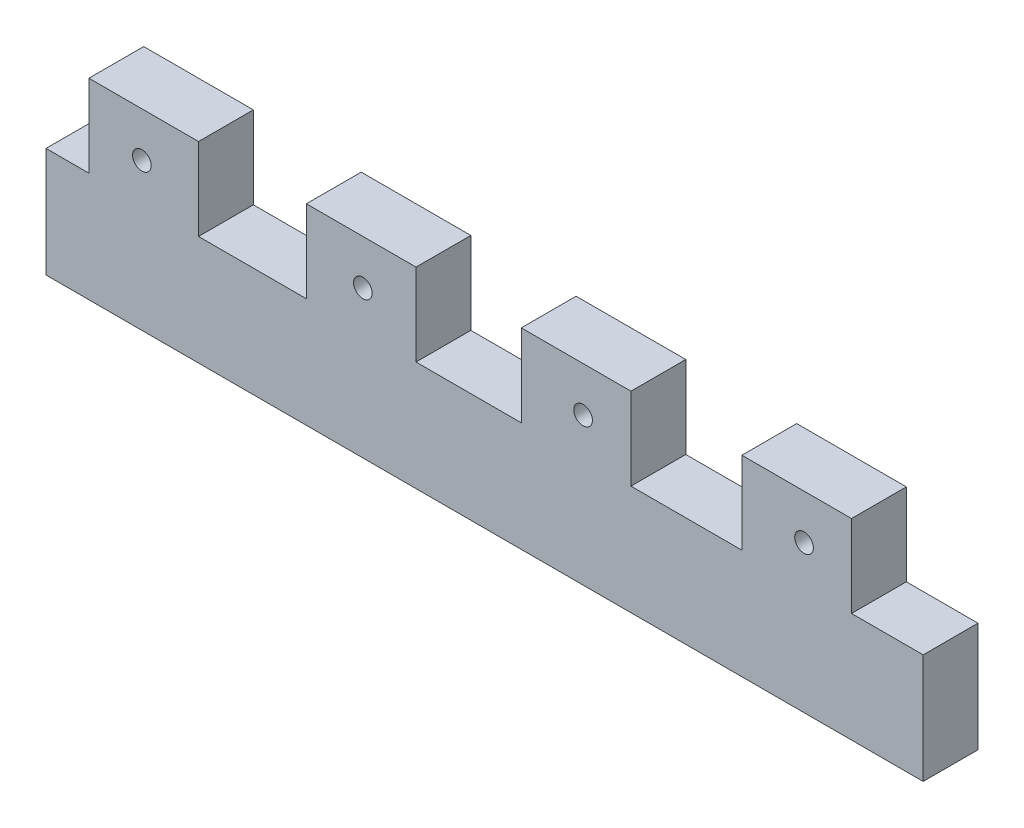
ISO-10303-21;
HEADER;
FILE_DESCRIPTION(('STEP AP214'),'2;1');
FILE_NAME('part.step','',(''),(''),'','','');
FILE_SCHEMA(('AUTOMOTIVE_DESIGN { 1 0 10303 214 1 1 1 1 }'));
ENDSEC;
DATA;
#1=APPLICATION_CONTEXT('core data for automotive mechanical design processes');
#2=APPLICATION_PROTOCOL_DEFINITION('international standard','automotive_design',2000,#1);
#3=PRODUCT_CONTEXT('',#1,'mechanical');
#4=PRODUCT('Part','Part','',(#3));
#5=PRODUCT_RELATED_PRODUCT_CATEGORY('part','',(#4));
#6=PRODUCT_DEFINITION_FORMATION('','',#4);
#7=PRODUCT_DEFINITION_CONTEXT('part definition',#1,'design');
#8=PRODUCT_DEFINITION('design','',#6,#7);
#9=PRODUCT_DEFINITION_SHAPE('','',#8);
#10=(LENGTH_UNIT() NAMED_UNIT(*) SI_UNIT(.MILLI.,.METRE.));
#11=(NAMED_UNIT(*) PLANE_ANGLE_UNIT() SI_UNIT($,.RADIAN.));
#12=(NAMED_UNIT(*) SI_UNIT($,.STERADIAN.) SOLID_ANGLE_UNIT());
#13=UNCERTAINTY_MEASURE_WITH_UNIT(LENGTH_MEASURE(1.E-05),#10,'distance_accuracy_value','');
#14=(GEOMETRIC_REPRESENTATION_CONTEXT(3) GLOBAL_UNCERTAINTY_ASSIGNED_CONTEXT((#13)) GLOBAL_UNIT_ASSIGNED_CONTEXT((#10,
#11,#12)) REPRESENTATION_CONTEXT('',''));
#15=CARTESIAN_POINT('',(0.,0.,0.));
#16=DIRECTION('',(0.,0.,1.));
#17=DIRECTION('',(1.,0.,0.));
#18=AXIS2_PLACEMENT_3D('',#15,#16,#17);
#19=CARTESIAN_POINT('',(4.96637370783451,0.,6.35));
#20=DIRECTION('',(-1.,0.,0.));
#21=DIRECTION('',(0.,0.,1.));
#22=AXIS2_PLACEMENT_3D('',#19,#20,#21);
#23=PLANE('',#22);
#24=DIRECTION('',(0.,1.,0.));
#25=VECTOR('',#24,1.);
#26=CARTESIAN_POINT('',(4.96637370783451,0.,0.));
#27=LINE('',#26,#25);
#28=CARTESIAN_POINT('',(4.96637370783451,12.7,0.));
#29=VERTEX_POINT('',#28);
#30=CARTESIAN_POINT('',(4.96637370783451,22.225,0.));
#31=VERTEX_POINT('',#30);
#32=EDGE_CURVE('E277',#29,#31,#27,.T.);
#33=ORIENTED_EDGE('',*,*,#32,.F.);
#34=DIRECTION('',(0.,0.,-1.));
#35=VECTOR('',#34,1.);
#36=CARTESIAN_POINT('',(4.96637370783451,12.7,6.35));
#37=LINE('',#36,#35);
#38=CARTESIAN_POINT('',(4.96637370783451,12.7,6.35));
#39=VERTEX_POINT('',#38);
#40=EDGE_CURVE('E11',#39,#29,#37,.T.);
#41=ORIENTED_EDGE('',*,*,#40,.F.);
#42=DIRECTION('',(0.,1.,0.));
#43=VECTOR('',#42,1.);
#44=CARTESIAN_POINT('',(4.96637370783451,0.,6.35));
#45=LINE('',#44,#43);
#46=CARTESIAN_POINT('',(4.96637370783451,22.225,6.35));
#47=VERTEX_POINT('',#46);
#48=EDGE_CURVE('E226',#39,#47,#45,.T.);
#49=ORIENTED_EDGE('',*,*,#48,.T.);
#50=DIRECTION('',(0.,0.,-1.));
#51=VECTOR('',#50,1.);
#52=CARTESIAN_POINT('',(4.96637370783451,22.225,6.35));
#53=LINE('',#52,#51);
#54=EDGE_CURVE('E62',#47,#31,#53,.T.);
#55=ORIENTED_EDGE('',*,*,#54,.T.);
#56=EDGE_LOOP('',(#33,#41,#49,#55));
#57=FACE_BOUND('',#56,.T.);
#58=ADVANCED_FACE('F45',(#57),#23,.T.);
#59=CARTESIAN_POINT('',(0.,12.7,6.35));
#60=DIRECTION('',(0.,1.,0.));
#61=DIRECTION('',(0.,0.,1.));
#62=AXIS2_PLACEMENT_3D('',#59,#60,#61);
#63=PLANE('',#62);
#64=DIRECTION('',(1.,0.,0.));
#65=VECTOR('',#64,1.);
#66=CARTESIAN_POINT('',(0.,12.7,0.));
#67=LINE('',#66,#65);
#68=CARTESIAN_POINT('',(0.,12.7,0.));
#69=VERTEX_POINT('',#68);
#70=EDGE_CURVE('E280',#69,#29,#67,.T.);
#71=ORIENTED_EDGE('',*,*,#70,.F.);
#72=DIRECTION('',(0.,0.,-1.));
#73=VECTOR('',#72,1.);
#74=CARTESIAN_POINT('',(0.,12.7,6.35));
#75=LINE('',#74,#73);
#76=CARTESIAN_POINT('',(0.,12.7,6.35));
#77=VERTEX_POINT('',#76);
#78=EDGE_CURVE('E54',#77,#69,#75,.T.);
#79=ORIENTED_EDGE('',*,*,#78,.F.);
#80=DIRECTION('',(1.,0.,0.));
#81=VECTOR('',#80,1.);
#82=CARTESIAN_POINT('',(0.,12.7,6.35));
#83=LINE('',#82,#81);
#84=EDGE_CURVE('E212',#77,#39,#83,.T.);
#85=ORIENTED_EDGE('',*,*,#84,.T.);
#86=ORIENTED_EDGE('',*,*,#40,.T.);
#87=EDGE_LOOP('',(#71,#79,#85,#86));
#88=FACE_BOUND('',#87,.T.);
#89=ADVANCED_FACE('F395',(#88),#63,.T.);
#90=CARTESIAN_POINT('',(0.,0.,6.35));
#91=DIRECTION('',(-1.,0.,0.));
#92=DIRECTION('',(0.,0.,1.));
#93=AXIS2_PLACEMENT_3D('',#90,#91,#92);
#94=PLANE('',#93);
#95=DIRECTION('',(0.,1.,0.));
#96=VECTOR('',#95,1.);
#97=CARTESIAN_POINT('',(0.,0.,0.));
#98=LINE('',#97,#96);
#99=CARTESIAN_POINT('',(0.,0.,0.));
#100=VERTEX_POINT('',#99);
#101=EDGE_CURVE('E285',#100,#69,#98,.T.);
#102=ORIENTED_EDGE('',*,*,#101,.F.);
#103=DIRECTION('',(0.,0.,-1.));
#104=VECTOR('',#103,1.);
#105=CARTESIAN_POINT('',(0.,0.,6.35));
#106=LINE('',#105,#104);
#107=CARTESIAN_POINT('',(0.,0.,6.35));
#108=VERTEX_POINT('',#107);
#109=EDGE_CURVE('E387',#108,#100,#106,.T.);
#110=ORIENTED_EDGE('',*,*,#109,.F.);
#111=DIRECTION('',(0.,1.,0.));
#112=VECTOR('',#111,1.);
#113=CARTESIAN_POINT('',(0.,0.,6.35));
#114=LINE('',#113,#112);
#115=EDGE_CURVE('E225',#108,#77,#114,.T.);
#116=ORIENTED_EDGE('',*,*,#115,.T.);
#117=ORIENTED_EDGE('',*,*,#78,.T.);
#118=EDGE_LOOP('',(#102,#110,#116,#117));
#119=FACE_BOUND('',#118,.T.);
#120=ADVANCED_FACE('F393',(#119),#94,.T.);
#121=CARTESIAN_POINT('',(0.,0.,6.35));
#122=DIRECTION('',(0.,1.,0.));
#123=DIRECTION('',(0.,0.,1.));
#124=AXIS2_PLACEMENT_3D('',#121,#122,#123);
#125=PLANE('',#124);
#126=DIRECTION('',(1.,0.,0.));
#127=VECTOR('',#126,1.);
#128=CARTESIAN_POINT('',(0.,0.,0.));
#129=LINE('',#128,#127);
#130=CARTESIAN_POINT('',(101.6,0.,0.));
#131=VERTEX_POINT('',#130);
#132=EDGE_CURVE('E290',#100,#131,#129,.T.);
#133=ORIENTED_EDGE('',*,*,#132,.T.);
#134=DIRECTION('',(0.,0.,-1.));
#135=VECTOR('',#134,1.);
#136=CARTESIAN_POINT('',(101.6,0.,6.35));
#137=LINE('',#136,#135);
#138=CARTESIAN_POINT('',(101.6,0.,6.35));
#139=VERTEX_POINT('',#138);
#140=EDGE_CURVE('E383',#139,#131,#137,.T.);
#141=ORIENTED_EDGE('',*,*,#140,.F.);
#142=DIRECTION('',(1.,0.,0.));
#143=VECTOR('',#142,1.);
#144=CARTESIAN_POINT('',(0.,0.,6.35));
#145=LINE('',#144,#143);
#146=EDGE_CURVE('E233',#108,#139,#145,.T.);
#147=ORIENTED_EDGE('',*,*,#146,.F.);
#148=ORIENTED_EDGE('',*,*,#109,.T.);
#149=EDGE_LOOP('',(#133,#141,#147,#148));
#150=FACE_BOUND('',#149,.T.);
#151=ADVANCED_FACE('F403',(#150),#125,.F.);
#152=CARTESIAN_POINT('',(101.6,0.,6.35));
#153=DIRECTION('',(-1.,0.,0.));
#154=DIRECTION('',(0.,0.,1.));
#155=AXIS2_PLACEMENT_3D('',#152,#153,#154);
#156=PLANE('',#155);
#157=DIRECTION('',(0.,1.,0.));
#158=VECTOR('',#157,1.);
#159=CARTESIAN_POINT('',(101.6,0.,0.));
#160=LINE('',#159,#158);
#161=CARTESIAN_POINT('',(101.6,12.7,0.));
#162=VERTEX_POINT('',#161);
#163=EDGE_CURVE('E293',#131,#162,#160,.T.);
#164=ORIENTED_EDGE('',*,*,#163,.T.);
#165=DIRECTION('',(0.,0.,-1.));
#166=VECTOR('',#165,1.);
#167=CARTESIAN_POINT('',(101.6,12.7,6.35));
#168=LINE('',#167,#166);
#169=CARTESIAN_POINT('',(101.6,12.7,6.35));
#170=VERTEX_POINT('',#169);
#171=EDGE_CURVE('E380',#170,#162,#168,.T.);
#172=ORIENTED_EDGE('',*,*,#171,.F.);
#173=DIRECTION('',(0.,1.,0.));
#174=VECTOR('',#173,1.);
#175=CARTESIAN_POINT('',(101.6,0.,6.35));
#176=LINE('',#175,#174);
#177=EDGE_CURVE('E238',#139,#170,#176,.T.);
#178=ORIENTED_EDGE('',*,*,#177,.F.);
#179=ORIENTED_EDGE('',*,*,#140,.T.);
#180=EDGE_LOOP('',(#164,#172,#178,#179));
#181=FACE_BOUND('',#180,.T.);
#182=ADVANCED_FACE('F407',(#181),#156,.F.);
#183=CARTESIAN_POINT('',(93.3004855400857,12.7,0.));
#184=VERTEX_POINT('',#183);
#185=EDGE_CURVE('E286',#184,#162,#67,.T.);
#186=ORIENTED_EDGE('',*,*,#185,.F.);
#187=DIRECTION('',(0.,0.,-1.));
#188=VECTOR('',#187,1.);
#189=CARTESIAN_POINT('',(93.3004855400857,12.7,6.35));
#190=LINE('',#189,#188);
#191=CARTESIAN_POINT('',(93.3004855400857,12.7,6.35));
#192=VERTEX_POINT('',#191);
#193=EDGE_CURVE('E377',#192,#184,#190,.T.);
#194=ORIENTED_EDGE('',*,*,#193,.F.);
#195=EDGE_CURVE('E227',#192,#170,#83,.T.);
#196=ORIENTED_EDGE('',*,*,#195,.T.);
#197=ORIENTED_EDGE('',*,*,#171,.T.);
#198=EDGE_LOOP('',(#186,#194,#196,#197));
#199=FACE_BOUND('',#198,.T.);
#200=ADVANCED_FACE('F416',(#199),#63,.T.);
#201=CARTESIAN_POINT('',(93.3004855400857,-1.35937463589645E-13,6.35));
#202=DIRECTION('',(-1.,0.,0.));
#203=DIRECTION('',(0.,-1.,0.));
#204=AXIS2_PLACEMENT_3D('',#201,#202,#203);
#205=PLANE('',#204);
#206=DIRECTION('',(0.,1.,0.));
#207=VECTOR('',#206,1.);
#208=CARTESIAN_POINT('',(93.3004855400857,-1.35937463589645E-13,0.));
#209=LINE('',#208,#207);
#210=CARTESIAN_POINT('',(93.3004855400857,22.225,0.));
#211=VERTEX_POINT('',#210);
#212=EDGE_CURVE('E297',#184,#211,#209,.T.);
#213=ORIENTED_EDGE('',*,*,#212,.T.);
#214=DIRECTION('',(0.,0.,-1.));
#215=VECTOR('',#214,1.);
#216=CARTESIAN_POINT('',(93.3004855400857,22.225,6.35));
#217=LINE('',#216,#215);
#218=CARTESIAN_POINT('',(93.3004855400857,22.225,6.35));
#219=VERTEX_POINT('',#218);
#220=EDGE_CURVE('E374',#219,#211,#217,.T.);
#221=ORIENTED_EDGE('',*,*,#220,.F.);
#222=DIRECTION('',(0.,1.,0.));
#223=VECTOR('',#222,1.);
#224=CARTESIAN_POINT('',(93.3004855400857,-1.35937463589645E-13,6.35));
#225=LINE('',#224,#223);
#226=EDGE_CURVE('E237',#192,#219,#225,.T.);
#227=ORIENTED_EDGE('',*,*,#226,.F.);
#228=ORIENTED_EDGE('',*,*,#193,.T.);
#229=EDGE_LOOP('',(#213,#221,#227,#228));
#230=FACE_BOUND('',#229,.T.);
#231=ADVANCED_FACE('F423',(#230),#205,.F.);
#232=CARTESIAN_POINT('',(0.,22.225,6.35));
#233=DIRECTION('',(0.,1.,0.));
#234=DIRECTION('',(0.,0.,1.));
#235=AXIS2_PLACEMENT_3D('',#232,#233,#234);
#236=PLANE('',#235);
#237=DIRECTION('',(1.,0.,0.));
#238=VECTOR('',#237,1.);
#239=CARTESIAN_POINT('',(0.,22.225,0.));
#240=LINE('',#239,#238);
#241=CARTESIAN_POINT('',(80.6004855400857,22.225,0.));
#242=VERTEX_POINT('',#241);
#243=EDGE_CURVE('E301',#242,#211,#240,.T.);
#244=ORIENTED_EDGE('',*,*,#243,.F.);
#245=DIRECTION('',(0.,0.,-1.));
#246=VECTOR('',#245,1.);
#247=CARTESIAN_POINT('',(80.6004855400857,22.225,6.35));
#248=LINE('',#247,#246);
#249=CARTESIAN_POINT('',(80.6004855400857,22.225,6.35));
#250=VERTEX_POINT('',#249);
#251=EDGE_CURVE('E371',#250,#242,#248,.T.);
#252=ORIENTED_EDGE('',*,*,#251,.F.);
#253=DIRECTION('',(1.,0.,0.));
#254=VECTOR('',#253,1.);
#255=CARTESIAN_POINT('',(0.,22.225,6.35));
#256=LINE('',#255,#254);
#257=EDGE_CURVE('E243',#250,#219,#256,.T.);
#258=ORIENTED_EDGE('',*,*,#257,.T.);
#259=ORIENTED_EDGE('',*,*,#220,.T.);
#260=EDGE_LOOP('',(#244,#252,#258,#259));
#261=FACE_BOUND('',#260,.T.);
#262=ADVANCED_FACE('F458',(#261),#236,.T.);
#263=CARTESIAN_POINT('',(80.6004855400857,0.,6.35));
#264=DIRECTION('',(-1.,0.,0.));
#265=DIRECTION('',(0.,0.,1.));
#266=AXIS2_PLACEMENT_3D('',#263,#264,#265);
#267=PLANE('',#266);
#268=DIRECTION('',(0.,1.,0.));
#269=VECTOR('',#268,1.);
#270=CARTESIAN_POINT('',(80.6004855400857,0.,0.));
#271=LINE('',#270,#269);
#272=CARTESIAN_POINT('',(80.6004855400857,12.7,0.));
#273=VERTEX_POINT('',#272);
#274=EDGE_CURVE('E305',#273,#242,#271,.T.);
#275=ORIENTED_EDGE('',*,*,#274,.F.);
#276=DIRECTION('',(0.,0.,-1.));
#277=VECTOR('',#276,1.);
#278=CARTESIAN_POINT('',(80.6004855400857,12.7,6.35));
#279=LINE('',#278,#277);
#280=CARTESIAN_POINT('',(80.6004855400857,12.7,6.35));
#281=VERTEX_POINT('',#280);
#282=EDGE_CURVE('E368',#281,#273,#279,.T.);
#283=ORIENTED_EDGE('',*,*,#282,.F.);
#284=DIRECTION('',(0.,1.,0.));
#285=VECTOR('',#284,1.);
#286=CARTESIAN_POINT('',(80.6004855400857,0.,6.35));
#287=LINE('',#286,#285);
#288=EDGE_CURVE('E249',#281,#250,#287,.T.);
#289=ORIENTED_EDGE('',*,*,#288,.T.);
#290=ORIENTED_EDGE('',*,*,#251,.T.);
#291=EDGE_LOOP('',(#275,#283,#289,#290));
#292=FACE_BOUND('',#291,.T.);
#293=ADVANCED_FACE('F451',(#292),#267,.T.);
#294=CARTESIAN_POINT('',(67.7512129362644,12.7,0.));
#295=VERTEX_POINT('',#294);
#296=EDGE_CURVE('E309',#295,#273,#67,.T.);
#297=ORIENTED_EDGE('',*,*,#296,.F.);
#298=DIRECTION('',(0.,0.,-1.));
#299=VECTOR('',#298,1.);
#300=CARTESIAN_POINT('',(67.7512129362644,12.7,6.35));
#301=LINE('',#300,#299);
#302=CARTESIAN_POINT('',(67.7512129362644,12.7,6.35));
#303=VERTEX_POINT('',#302);
#304=EDGE_CURVE('E365',#303,#295,#301,.T.);
#305=ORIENTED_EDGE('',*,*,#304,.F.);
#306=EDGE_CURVE('E222',#303,#281,#83,.T.);
#307=ORIENTED_EDGE('',*,*,#306,.T.);
#308=ORIENTED_EDGE('',*,*,#282,.T.);
#309=EDGE_LOOP('',(#297,#305,#307,#308));
#310=FACE_BOUND('',#309,.T.);
#311=ADVANCED_FACE('F424',(#310),#63,.T.);
#312=CARTESIAN_POINT('',(67.7512129362643,-1.97425082803471E-13,6.35));
#313=DIRECTION('',(-1.,0.,0.));
#314=DIRECTION('',(0.,-1.,0.));
#315=AXIS2_PLACEMENT_3D('',#312,#313,#314);
#316=PLANE('',#315);
#317=DIRECTION('',(0.,1.,0.));
#318=VECTOR('',#317,1.);
#319=CARTESIAN_POINT('',(67.7512129362643,-1.97425082803471E-13,0.));
#320=LINE('',#319,#318);
#321=CARTESIAN_POINT('',(67.7512129362644,22.225,0.));
#322=VERTEX_POINT('',#321);
#323=EDGE_CURVE('E310',#295,#322,#320,.T.);
#324=ORIENTED_EDGE('',*,*,#323,.T.);
#325=DIRECTION('',(0.,0.,-1.));
#326=VECTOR('',#325,1.);
#327=CARTESIAN_POINT('',(67.7512129362644,22.225,6.35));
#328=LINE('',#327,#326);
#329=CARTESIAN_POINT('',(67.7512129362644,22.225,6.35));
#330=VERTEX_POINT('',#329);
#331=EDGE_CURVE('E362',#330,#322,#328,.T.);
#332=ORIENTED_EDGE('',*,*,#331,.F.);
#333=DIRECTION('',(0.,1.,0.));
#334=VECTOR('',#333,1.);
#335=CARTESIAN_POINT('',(67.7512129362643,-1.97425082803471E-13,6.35));
#336=LINE('',#335,#334);
#337=EDGE_CURVE('E248',#303,#330,#336,.T.);
#338=ORIENTED_EDGE('',*,*,#337,.F.);
#339=ORIENTED_EDGE('',*,*,#304,.T.);
#340=EDGE_LOOP('',(#324,#332,#338,#339));
#341=FACE_BOUND('',#340,.T.);
#342=ADVANCED_FACE('F450',(#341),#316,.F.);
#343=CARTESIAN_POINT('',(0.,22.225,6.35));
#344=DIRECTION('',(0.,1.,0.));
#345=DIRECTION('',(0.,0.,1.));
#346=AXIS2_PLACEMENT_3D('',#343,#344,#345);
#347=PLANE('',#346);
#348=DIRECTION('',(1.,0.,0.));
#349=VECTOR('',#348,1.);
#350=CARTESIAN_POINT('',(0.,22.225,0.));
#351=LINE('',#350,#349);
#352=CARTESIAN_POINT('',(55.0512129362644,22.225,0.));
#353=VERTEX_POINT('',#352);
#354=EDGE_CURVE('E314',#353,#322,#351,.T.);
#355=ORIENTED_EDGE('',*,*,#354,.F.);
#356=DIRECTION('',(0.,0.,-1.));
#357=VECTOR('',#356,1.);
#358=CARTESIAN_POINT('',(55.0512129362644,22.225,6.35));
#359=LINE('',#358,#357);
#360=CARTESIAN_POINT('',(55.0512129362644,22.225,6.35));
#361=VERTEX_POINT('',#360);
#362=EDGE_CURVE('E359',#361,#353,#359,.T.);
#363=ORIENTED_EDGE('',*,*,#362,.F.);
#364=DIRECTION('',(1.,0.,0.));
#365=VECTOR('',#364,1.);
#366=CARTESIAN_POINT('',(0.,22.225,6.35));
#367=LINE('',#366,#365);
#368=EDGE_CURVE('E254',#361,#330,#367,.T.);
#369=ORIENTED_EDGE('',*,*,#368,.T.);
#370=ORIENTED_EDGE('',*,*,#331,.T.);
#371=EDGE_LOOP('',(#355,#363,#369,#370));
#372=FACE_BOUND('',#371,.T.);
#373=ADVANCED_FACE('F445',(#372),#347,.T.);
#374=CARTESIAN_POINT('',(55.0512129362643,-1.60417648649299E-13,6.35));
#375=DIRECTION('',(-1.,0.,0.));
#376=DIRECTION('',(0.,-1.,0.));
#377=AXIS2_PLACEMENT_3D('',#374,#375,#376);
#378=PLANE('',#377);
#379=DIRECTION('',(0.,1.,0.));
#380=VECTOR('',#379,1.);
#381=CARTESIAN_POINT('',(55.0512129362643,-1.60417648649299E-13,0.));
#382=LINE('',#381,#380);
#383=CARTESIAN_POINT('',(55.0512129362644,12.7,0.));
#384=VERTEX_POINT('',#383);
#385=EDGE_CURVE('E318',#384,#353,#382,.T.);
#386=ORIENTED_EDGE('',*,*,#385,.F.);
#387=DIRECTION('',(0.,0.,-1.));
#388=VECTOR('',#387,1.);
#389=CARTESIAN_POINT('',(55.0512129362644,12.7,6.35));
#390=LINE('',#389,#388);
#391=CARTESIAN_POINT('',(55.0512129362644,12.7,6.35));
#392=VERTEX_POINT('',#391);
#393=EDGE_CURVE('E356',#392,#384,#390,.T.);
#394=ORIENTED_EDGE('',*,*,#393,.F.);
#395=DIRECTION('',(0.,1.,0.));
#396=VECTOR('',#395,1.);
#397=CARTESIAN_POINT('',(55.0512129362643,-1.60417648649299E-13,6.35));
#398=LINE('',#397,#396);
#399=EDGE_CURVE('E221',#392,#361,#398,.T.);
#400=ORIENTED_EDGE('',*,*,#399,.T.);
#401=ORIENTED_EDGE('',*,*,#362,.T.);
#402=EDGE_LOOP('',(#386,#394,#400,#401));
#403=FACE_BOUND('',#402,.T.);
#404=ADVANCED_FACE('F437',(#403),#378,.T.);
#405=CARTESIAN_POINT('',(42.8578553435626,12.7,0.));
#406=VERTEX_POINT('',#405);
#407=EDGE_CURVE('E322',#406,#384,#67,.T.);
#408=ORIENTED_EDGE('',*,*,#407,.F.);
#409=DIRECTION('',(0.,0.,-1.));
#410=VECTOR('',#409,1.);
#411=CARTESIAN_POINT('',(42.8578553435626,12.7,6.35));
#412=LINE('',#411,#410);
#413=CARTESIAN_POINT('',(42.8578553435626,12.7,6.35));
#414=VERTEX_POINT('',#413);
#415=EDGE_CURVE('E353',#414,#406,#412,.T.);
#416=ORIENTED_EDGE('',*,*,#415,.F.);
#417=EDGE_CURVE('E211',#414,#392,#83,.T.);
#418=ORIENTED_EDGE('',*,*,#417,.T.);
#419=ORIENTED_EDGE('',*,*,#393,.T.);
#420=EDGE_LOOP('',(#408,#416,#418,#419));
#421=FACE_BOUND('',#420,.T.);
#422=ADVANCED_FACE('F427',(#421),#63,.T.);
#423=CARTESIAN_POINT('',(42.8578553435626,0.,6.35));
#424=DIRECTION('',(-1.,0.,0.));
#425=DIRECTION('',(0.,0.,1.));
#426=AXIS2_PLACEMENT_3D('',#423,#424,#425);
#427=PLANE('',#426);
#428=DIRECTION('',(0.,1.,0.));
#429=VECTOR('',#428,1.);
#430=CARTESIAN_POINT('',(42.8578553435626,0.,0.));
#431=LINE('',#430,#429);
#432=CARTESIAN_POINT('',(42.8578553435626,22.225,0.));
#433=VERTEX_POINT('',#432);
#434=EDGE_CURVE('E323',#406,#433,#431,.T.);
#435=ORIENTED_EDGE('',*,*,#434,.T.);
#436=DIRECTION('',(0.,0.,-1.));
#437=VECTOR('',#436,1.);
#438=CARTESIAN_POINT('',(42.8578553435626,22.225,6.35));
#439=LINE('',#438,#437);
#440=CARTESIAN_POINT('',(42.8578553435626,22.225,6.35));
#441=VERTEX_POINT('',#440);
#442=EDGE_CURVE('E350',#441,#433,#439,.T.);
#443=ORIENTED_EDGE('',*,*,#442,.F.);
#444=DIRECTION('',(0.,1.,0.));
#445=VECTOR('',#444,1.);
#446=CARTESIAN_POINT('',(42.8578553435626,0.,6.35));
#447=LINE('',#446,#445);
#448=EDGE_CURVE('E220',#414,#441,#447,.T.);
#449=ORIENTED_EDGE('',*,*,#448,.F.);
#450=ORIENTED_EDGE('',*,*,#415,.T.);
#451=EDGE_LOOP('',(#435,#443,#449,#450));
#452=FACE_BOUND('',#451,.T.);
#453=ADVANCED_FACE('F436',(#452),#427,.F.);
#454=CARTESIAN_POINT('',(0.,22.225,6.35));
#455=DIRECTION('',(0.,1.,0.));
#456=DIRECTION('',(0.,0.,1.));
#457=AXIS2_PLACEMENT_3D('',#454,#455,#456);
#458=PLANE('',#457);
#459=DIRECTION('',(1.,0.,0.));
#460=VECTOR('',#459,1.);
#461=CARTESIAN_POINT('',(0.,22.225,0.));
#462=LINE('',#461,#460);
#463=CARTESIAN_POINT('',(30.1578553435626,22.225,0.));
#464=VERTEX_POINT('',#463);
#465=EDGE_CURVE('E327',#464,#433,#462,.T.);
#466=ORIENTED_EDGE('',*,*,#465,.F.);
#467=DIRECTION('',(0.,0.,-1.));
#468=VECTOR('',#467,1.);
#469=CARTESIAN_POINT('',(30.1578553435626,22.225,6.35));
#470=LINE('',#469,#468);
#471=CARTESIAN_POINT('',(30.1578553435626,22.225,6.35));
#472=VERTEX_POINT('',#471);
#473=EDGE_CURVE('E347',#472,#464,#470,.T.);
#474=ORIENTED_EDGE('',*,*,#473,.F.);
#475=DIRECTION('',(1.,0.,0.));
#476=VECTOR('',#475,1.);
#477=CARTESIAN_POINT('',(0.,22.225,6.35));
#478=LINE('',#477,#476);
#479=EDGE_CURVE('E214',#472,#441,#478,.T.);
#480=ORIENTED_EDGE('',*,*,#479,.T.);
#481=ORIENTED_EDGE('',*,*,#442,.T.);
#482=EDGE_LOOP('',(#466,#474,#480,#481));
#483=FACE_BOUND('',#482,.T.);
#484=ADVANCED_FACE('F433',(#483),#458,.T.);
#485=CARTESIAN_POINT('',(30.1578553435626,0.,6.35));
#486=DIRECTION('',(-1.,0.,0.));
#487=DIRECTION('',(0.,0.,1.));
#488=AXIS2_PLACEMENT_3D('',#485,#486,#487);
#489=PLANE('',#488);
#490=DIRECTION('',(0.,1.,0.));
#491=VECTOR('',#490,1.);
#492=CARTESIAN_POINT('',(30.1578553435626,0.,0.));
#493=LINE('',#492,#491);
#494=CARTESIAN_POINT('',(30.1578553435626,12.7,0.));
#495=VERTEX_POINT('',#494);
#496=EDGE_CURVE('E331',#495,#464,#493,.T.);
#497=ORIENTED_EDGE('',*,*,#496,.F.);
#498=DIRECTION('',(0.,0.,-1.));
#499=VECTOR('',#498,1.);
#500=CARTESIAN_POINT('',(30.1578553435626,12.7,6.35));
#501=LINE('',#500,#499);
#502=CARTESIAN_POINT('',(30.1578553435626,12.7,6.35));
#503=VERTEX_POINT('',#502);
#504=EDGE_CURVE('E195',#503,#495,#501,.T.);
#505=ORIENTED_EDGE('',*,*,#504,.F.);
#506=DIRECTION('',(0.,1.,0.));
#507=VECTOR('',#506,1.);
#508=CARTESIAN_POINT('',(30.1578553435626,0.,6.35));
#509=LINE('',#508,#507);
#510=EDGE_CURVE('E208',#503,#472,#509,.T.);
#511=ORIENTED_EDGE('',*,*,#510,.T.);
#512=ORIENTED_EDGE('',*,*,#473,.T.);
#513=EDGE_LOOP('',(#497,#505,#511,#512));
#514=FACE_BOUND('',#513,.T.);
#515=ADVANCED_FACE('F426',(#514),#489,.T.);
#516=CARTESIAN_POINT('',(17.6663737078345,12.7,0.));
#517=VERTEX_POINT('',#516);
#518=EDGE_CURVE('E191',#517,#495,#67,.T.);
#519=ORIENTED_EDGE('',*,*,#518,.F.);
#520=DIRECTION('',(0.,0.,-1.));
#521=VECTOR('',#520,1.);
#522=CARTESIAN_POINT('',(17.6663737078345,12.7,6.35));
#523=LINE('',#522,#521);
#524=CARTESIAN_POINT('',(17.6663737078345,12.7,6.35));
#525=VERTEX_POINT('',#524);
#526=EDGE_CURVE('E185',#525,#517,#523,.T.);
#527=ORIENTED_EDGE('',*,*,#526,.F.);
#528=EDGE_CURVE('E189',#525,#503,#83,.T.);
#529=ORIENTED_EDGE('',*,*,#528,.T.);
#530=ORIENTED_EDGE('',*,*,#504,.T.);
#531=EDGE_LOOP('',(#519,#527,#529,#530));
#532=FACE_BOUND('',#531,.T.);
#533=ADVANCED_FACE('F187',(#532),#63,.T.);
#534=CARTESIAN_POINT('',(17.6663737078345,0.,6.35));
#535=DIRECTION('',(-1.,0.,0.));
#536=DIRECTION('',(0.,0.,1.));
#537=AXIS2_PLACEMENT_3D('',#534,#535,#536);
#538=PLANE('',#537);
#539=DIRECTION('',(0.,1.,0.));
#540=VECTOR('',#539,1.);
#541=CARTESIAN_POINT('',(17.6663737078345,0.,0.));
#542=LINE('',#541,#540);
#543=CARTESIAN_POINT('',(17.6663737078345,22.225,0.));
#544=VERTEX_POINT('',#543);
#545=EDGE_CURVE('E335',#517,#544,#542,.T.);
#546=ORIENTED_EDGE('',*,*,#545,.T.);
#547=DIRECTION('',(0.,0.,-1.));
#548=VECTOR('',#547,1.);
#549=CARTESIAN_POINT('',(17.6663737078345,22.225,6.35));
#550=LINE('',#549,#548);
#551=CARTESIAN_POINT('',(17.6663737078345,22.225,6.35));
#552=VERTEX_POINT('',#551);
#553=EDGE_CURVE('E124',#552,#544,#550,.T.);
#554=ORIENTED_EDGE('',*,*,#553,.F.);
#555=DIRECTION('',(0.,1.,0.));
#556=VECTOR('',#555,1.);
#557=CARTESIAN_POINT('',(17.6663737078345,0.,6.35));
#558=LINE('',#557,#556);
#559=EDGE_CURVE('E197',#525,#552,#558,.T.);
#560=ORIENTED_EDGE('',*,*,#559,.F.);
#561=ORIENTED_EDGE('',*,*,#526,.T.);
#562=EDGE_LOOP('',(#546,#554,#560,#561));
#563=FACE_BOUND('',#562,.T.);
#564=ADVANCED_FACE('F198',(#563),#538,.F.);
#565=CARTESIAN_POINT('',(0.,22.225,6.35));
#566=DIRECTION('',(0.,1.,0.));
#567=DIRECTION('',(0.,0.,1.));
#568=AXIS2_PLACEMENT_3D('',#565,#566,#567);
#569=PLANE('',#568);
#570=DIRECTION('',(1.,0.,0.));
#571=VECTOR('',#570,1.);
#572=CARTESIAN_POINT('',(0.,22.225,0.));
#573=LINE('',#572,#571);
#574=EDGE_CURVE('E234',#31,#544,#573,.T.);
#575=ORIENTED_EDGE('',*,*,#574,.F.);
#576=ORIENTED_EDGE('',*,*,#54,.F.);
#577=DIRECTION('',(1.,0.,0.));
#578=VECTOR('',#577,1.);
#579=CARTESIAN_POINT('',(0.,22.225,6.35));
#580=LINE('',#579,#578);
#581=EDGE_CURVE('E202',#47,#552,#580,.T.);
#582=ORIENTED_EDGE('',*,*,#581,.T.);
#583=ORIENTED_EDGE('',*,*,#553,.T.);
#584=EDGE_LOOP('',(#575,#576,#582,#583));
#585=FACE_BOUND('',#584,.T.);
#586=ADVANCED_FACE('F432',(#585),#569,.T.);
#587=CARTESIAN_POINT('',(0.,0.,6.35));
#588=DIRECTION('',(0.,0.,1.));
#589=DIRECTION('',(1.,0.,0.));
#590=AXIS2_PLACEMENT_3D('',#587,#588,#589);
#591=PLANE('',#590);
#592=CARTESIAN_POINT('',(62.2061899688972,17.0581617157705,6.35));
#593=DIRECTION('',(0.,0.,1.));
#594=DIRECTION('',(1.,0.,0.));
#595=AXIS2_PLACEMENT_3D('',#592,#593,#594);
#596=CIRCLE('',#595,1.0795);
#597=CARTESIAN_POINT('',(63.2856899688972,17.0581617157705,6.35));
#598=VERTEX_POINT('',#597);
#599=EDGE_CURVE('E503',#598,#598,#596,.T.);
#600=ORIENTED_EDGE('',*,*,#599,.F.);
#601=EDGE_LOOP('',(#600));
#602=FACE_BOUND('',#601,.T.);
#603=CARTESIAN_POINT('',(36.6986796428972,17.0581617157705,6.35));
#604=DIRECTION('',(0.,0.,1.));
#605=DIRECTION('',(1.,0.,0.));
#606=AXIS2_PLACEMENT_3D('',#603,#604,#605);
#607=CIRCLE('',#606,1.0795);
#608=CARTESIAN_POINT('',(37.7781796428972,17.0581617157705,6.35));
#609=VERTEX_POINT('',#608);
#610=EDGE_CURVE('E520',#609,#609,#607,.T.);
#611=ORIENTED_EDGE('',*,*,#610,.F.);
#612=EDGE_LOOP('',(#611));
#613=FACE_BOUND('',#612,.T.);
#614=CARTESIAN_POINT('',(11.1061900608972,17.0581617157705,6.35));
#615=DIRECTION('',(0.,0.,1.));
#616=DIRECTION('',(1.,0.,0.));
#617=AXIS2_PLACEMENT_3D('',#614,#615,#616);
#618=CIRCLE('',#617,1.0795);
#619=CARTESIAN_POINT('',(12.1856900608972,17.0581617157705,6.35));
#620=VERTEX_POINT('',#619);
#621=EDGE_CURVE('E528',#620,#620,#618,.T.);
#622=ORIENTED_EDGE('',*,*,#621,.F.);
#623=EDGE_LOOP('',(#622));
#624=FACE_BOUND('',#623,.T.);
#625=CARTESIAN_POINT('',(87.7986795508972,17.0581617157705,6.35));
#626=DIRECTION('',(0.,0.,1.));
#627=DIRECTION('',(1.,0.,0.));
#628=AXIS2_PLACEMENT_3D('',#625,#626,#627);
#629=CIRCLE('',#628,1.0795);
#630=CARTESIAN_POINT('',(88.8781795508972,17.0581617157705,6.35));
#631=VERTEX_POINT('',#630);
#632=EDGE_CURVE('E281',#631,#631,#629,.T.);
#633=ORIENTED_EDGE('',*,*,#632,.F.);
#634=EDGE_LOOP('',(#633));
#635=FACE_BOUND('',#634,.T.);
#636=ORIENTED_EDGE('',*,*,#48,.F.);
#637=ORIENTED_EDGE('',*,*,#84,.F.);
#638=ORIENTED_EDGE('',*,*,#115,.F.);
#639=ORIENTED_EDGE('',*,*,#146,.T.);
#640=ORIENTED_EDGE('',*,*,#177,.T.);
#641=ORIENTED_EDGE('',*,*,#195,.F.);
#642=ORIENTED_EDGE('',*,*,#226,.T.);
#643=ORIENTED_EDGE('',*,*,#257,.F.);
#644=ORIENTED_EDGE('',*,*,#288,.F.);
#645=ORIENTED_EDGE('',*,*,#306,.F.);
#646=ORIENTED_EDGE('',*,*,#337,.T.);
#647=ORIENTED_EDGE('',*,*,#368,.F.);
#648=ORIENTED_EDGE('',*,*,#399,.F.);
#649=ORIENTED_EDGE('',*,*,#417,.F.);
#650=ORIENTED_EDGE('',*,*,#448,.T.);
#651=ORIENTED_EDGE('',*,*,#479,.F.);
#652=ORIENTED_EDGE('',*,*,#510,.F.);
#653=ORIENTED_EDGE('',*,*,#528,.F.);
#654=ORIENTED_EDGE('',*,*,#559,.T.);
#655=ORIENTED_EDGE('',*,*,#581,.F.);
#656=EDGE_LOOP('',(#636,#637,#638,#639,#640,#641,#642,#643,#644,#645,#646,#647,#648,#649,#650,
#651,#652,#653,#654,#655));
#657=FACE_BOUND('',#656,.T.);
#658=ADVANCED_FACE('F205',(#602,#613,#624,#635,#657),#591,.T.);
#659=CARTESIAN_POINT('',(0.,0.,0.));
#660=DIRECTION('',(0.,0.,1.));
#661=DIRECTION('',(1.,0.,0.));
#662=AXIS2_PLACEMENT_3D('',#659,#660,#661);
#663=PLANE('',#662);
#664=CARTESIAN_POINT('',(62.2061899688972,17.0581617157705,0.));
#665=DIRECTION('',(0.,0.,1.));
#666=DIRECTION('',(1.,0.,0.));
#667=AXIS2_PLACEMENT_3D('',#664,#665,#666);
#668=CIRCLE('',#667,1.0795);
#669=CARTESIAN_POINT('',(63.2856899688972,17.0581617157705,0.));
#670=VERTEX_POINT('',#669);
#671=EDGE_CURVE('E506',#670,#670,#668,.T.);
#672=ORIENTED_EDGE('',*,*,#671,.T.);
#673=EDGE_LOOP('',(#672));
#674=FACE_BOUND('',#673,.T.);
#675=CARTESIAN_POINT('',(36.6986796428972,17.0581617157705,0.));
#676=DIRECTION('',(0.,0.,1.));
#677=DIRECTION('',(1.,0.,0.));
#678=AXIS2_PLACEMENT_3D('',#675,#676,#677);
#679=CIRCLE('',#678,1.0795);
#680=CARTESIAN_POINT('',(37.7781796428972,17.0581617157705,0.));
#681=VERTEX_POINT('',#680);
#682=EDGE_CURVE('E514',#681,#681,#679,.T.);
#683=ORIENTED_EDGE('',*,*,#682,.T.);
#684=EDGE_LOOP('',(#683));
#685=FACE_BOUND('',#684,.T.);
#686=CARTESIAN_POINT('',(11.1061900608972,17.0581617157705,0.));
#687=DIRECTION('',(0.,0.,1.));
#688=DIRECTION('',(1.,0.,0.));
#689=AXIS2_PLACEMENT_3D('',#686,#687,#688);
#690=CIRCLE('',#689,1.0795);
#691=CARTESIAN_POINT('',(12.1856900608972,17.0581617157705,0.));
#692=VERTEX_POINT('',#691);
#693=EDGE_CURVE('E524',#692,#692,#690,.T.);
#694=ORIENTED_EDGE('',*,*,#693,.T.);
#695=EDGE_LOOP('',(#694));
#696=FACE_BOUND('',#695,.T.);
#697=CARTESIAN_POINT('',(87.7986795508972,17.0581617157705,0.));
#698=DIRECTION('',(0.,0.,1.));
#699=DIRECTION('',(1.,0.,0.));
#700=AXIS2_PLACEMENT_3D('',#697,#698,#699);
#701=CIRCLE('',#700,1.0795);
#702=CARTESIAN_POINT('',(88.8781795508972,17.0581617157705,0.));
#703=VERTEX_POINT('',#702);
#704=EDGE_CURVE('E508',#703,#703,#701,.T.);
#705=ORIENTED_EDGE('',*,*,#704,.T.);
#706=EDGE_LOOP('',(#705));
#707=FACE_BOUND('',#706,.T.);
#708=ORIENTED_EDGE('',*,*,#32,.T.);
#709=ORIENTED_EDGE('',*,*,#574,.T.);
#710=ORIENTED_EDGE('',*,*,#545,.F.);
#711=ORIENTED_EDGE('',*,*,#518,.T.);
#712=ORIENTED_EDGE('',*,*,#496,.T.);
#713=ORIENTED_EDGE('',*,*,#465,.T.);
#714=ORIENTED_EDGE('',*,*,#434,.F.);
#715=ORIENTED_EDGE('',*,*,#407,.T.);
#716=ORIENTED_EDGE('',*,*,#385,.T.);
#717=ORIENTED_EDGE('',*,*,#354,.T.);
#718=ORIENTED_EDGE('',*,*,#323,.F.);
#719=ORIENTED_EDGE('',*,*,#296,.T.);
#720=ORIENTED_EDGE('',*,*,#274,.T.);
#721=ORIENTED_EDGE('',*,*,#243,.T.);
#722=ORIENTED_EDGE('',*,*,#212,.F.);
#723=ORIENTED_EDGE('',*,*,#185,.T.);
#724=ORIENTED_EDGE('',*,*,#163,.F.);
#725=ORIENTED_EDGE('',*,*,#132,.F.);
#726=ORIENTED_EDGE('',*,*,#101,.T.);
#727=ORIENTED_EDGE('',*,*,#70,.T.);
#728=EDGE_LOOP('',(#708,#709,#710,#711,#712,#713,#714,#715,#716,#717,#718,#719,#720,#721,#722,
#723,#724,#725,#726,#727));
#729=FACE_BOUND('',#728,.T.);
#730=ADVANCED_FACE('F398',(#674,#685,#696,#707,#729),#663,.F.);
#731=CARTESIAN_POINT('',(87.7986795508972,17.0581617157705,6.35));
#732=DIRECTION('',(0.,0.,-1.));
#733=DIRECTION('',(-1.,0.,0.));
#734=AXIS2_PLACEMENT_3D('',#731,#732,#733);
#735=CYLINDRICAL_SURFACE('',#734,1.0795);
#736=ORIENTED_EDGE('',*,*,#632,.T.);
#737=EDGE_LOOP('',(#736));
#738=FACE_BOUND('',#737,.T.);
#739=ORIENTED_EDGE('',*,*,#704,.F.);
#740=EDGE_LOOP('',(#739));
#741=FACE_BOUND('',#740,.T.);
#742=ADVANCED_FACE('F481',(#738,#741),#735,.F.);
#743=CARTESIAN_POINT('',(11.1061900608972,17.0581617157705,6.35));
#744=DIRECTION('',(0.,0.,-1.));
#745=DIRECTION('',(-1.,0.,0.));
#746=AXIS2_PLACEMENT_3D('',#743,#744,#745);
#747=CYLINDRICAL_SURFACE('',#746,1.0795);
#748=ORIENTED_EDGE('',*,*,#621,.T.);
#749=EDGE_LOOP('',(#748));
#750=FACE_BOUND('',#749,.T.);
#751=ORIENTED_EDGE('',*,*,#693,.F.);
#752=EDGE_LOOP('',(#751));
#753=FACE_BOUND('',#752,.T.);
#754=ADVANCED_FACE('F486',(#750,#753),#747,.F.);
#755=CARTESIAN_POINT('',(36.6986796428972,17.0581617157705,6.35));
#756=DIRECTION('',(0.,0.,-1.));
#757=DIRECTION('',(-1.,0.,0.));
#758=AXIS2_PLACEMENT_3D('',#755,#756,#757);
#759=CYLINDRICAL_SURFACE('',#758,1.0795);
#760=ORIENTED_EDGE('',*,*,#610,.T.);
#761=EDGE_LOOP('',(#760));
#762=FACE_BOUND('',#761,.T.);
#763=ORIENTED_EDGE('',*,*,#682,.F.);
#764=EDGE_LOOP('',(#763));
#765=FACE_BOUND('',#764,.T.);
#766=ADVANCED_FACE('F490',(#762,#765),#759,.F.);
#767=CARTESIAN_POINT('',(62.2061899688972,17.0581617157705,6.35));
#768=DIRECTION('',(0.,0.,-1.));
#769=DIRECTION('',(-1.,0.,0.));
#770=AXIS2_PLACEMENT_3D('',#767,#768,#769);
#771=CYLINDRICAL_SURFACE('',#770,1.0795);
#772=ORIENTED_EDGE('',*,*,#599,.T.);
#773=EDGE_LOOP('',(#772));
#774=FACE_BOUND('',#773,.T.);
#775=ORIENTED_EDGE('',*,*,#671,.F.);
#776=EDGE_LOOP('',(#775));
#777=FACE_BOUND('',#776,.T.);
#778=ADVANCED_FACE('F494',(#774,#777),#771,.F.);
#779=CLOSED_SHELL('',(#58,#89,#120,#151,#182,#200,#231,#262,#293,#311,#342,#373,#404,#422,#453,
#484,#515,#533,#564,#586,#658,#730,#742,#754,#766,#778));
#780=MANIFOLD_SOLID_BREP('B2',#779);
#781=ADVANCED_BREP_SHAPE_REPRESENTATION('',(#18,#780),#14);
#782=SHAPE_DEFINITION_REPRESENTATION(#9,#781);
ENDSEC;
END-ISO-10303-21;
